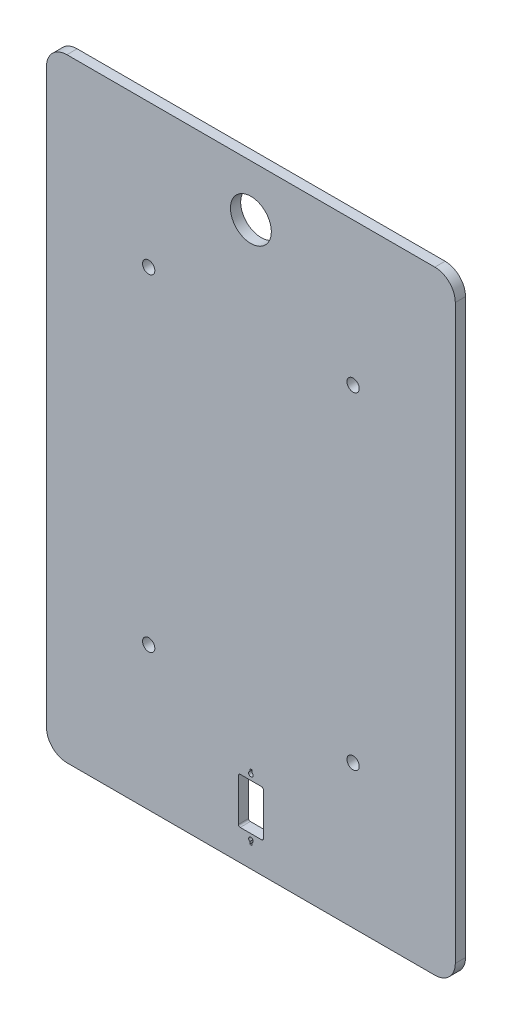
ISO-10303-21;
HEADER;
FILE_DESCRIPTION(('STEP AP214'),'2;1');
FILE_NAME('part.step','',(''),(''),'','','');
FILE_SCHEMA(('AUTOMOTIVE_DESIGN { 1 0 10303 214 1 1 1 1 }'));
ENDSEC;
DATA;
#1=APPLICATION_CONTEXT('core data for automotive mechanical design processes');
#2=APPLICATION_PROTOCOL_DEFINITION('international standard','automotive_design',2000,#1);
#3=PRODUCT_CONTEXT('',#1,'mechanical');
#4=PRODUCT('Part','Part','',(#3));
#5=PRODUCT_RELATED_PRODUCT_CATEGORY('part','',(#4));
#6=PRODUCT_DEFINITION_FORMATION('','',#4);
#7=PRODUCT_DEFINITION_CONTEXT('part definition',#1,'design');
#8=PRODUCT_DEFINITION('design','',#6,#7);
#9=PRODUCT_DEFINITION_SHAPE('','',#8);
#10=(LENGTH_UNIT() NAMED_UNIT(*) SI_UNIT(.MILLI.,.METRE.));
#11=(NAMED_UNIT(*) PLANE_ANGLE_UNIT() SI_UNIT($,.RADIAN.));
#12=(NAMED_UNIT(*) SI_UNIT($,.STERADIAN.) SOLID_ANGLE_UNIT());
#13=UNCERTAINTY_MEASURE_WITH_UNIT(LENGTH_MEASURE(1.E-05),#10,'distance_accuracy_value','');
#14=(GEOMETRIC_REPRESENTATION_CONTEXT(3) GLOBAL_UNCERTAINTY_ASSIGNED_CONTEXT((#13)) GLOBAL_UNIT_ASSIGNED_CONTEXT((#10,
#11,#12)) REPRESENTATION_CONTEXT('',''));
#15=CARTESIAN_POINT('',(0.,0.,0.));
#16=DIRECTION('',(0.,0.,1.));
#17=DIRECTION('',(1.,0.,0.));
#18=AXIS2_PLACEMENT_3D('',#15,#16,#17);
#19=CARTESIAN_POINT('',(-90.,-140.,5.));
#20=DIRECTION('',(0.,0.,1.));
#21=DIRECTION('',(1.,0.,0.));
#22=AXIS2_PLACEMENT_3D('',#19,#20,#21);
#23=PLANE('',#22);
#24=CARTESIAN_POINT('',(-50.,-80.,5.));
#25=DIRECTION('',(0.,0.,1.));
#26=DIRECTION('',(1.,0.,0.));
#27=AXIS2_PLACEMENT_3D('',#24,#25,#26);
#28=CIRCLE('',#27,3.00000000000001);
#29=CARTESIAN_POINT('',(-47.,-80.,5.));
#30=VERTEX_POINT('',#29);
#31=EDGE_CURVE('E296',#30,#30,#28,.T.);
#32=ORIENTED_EDGE('',*,*,#31,.F.);
#33=EDGE_LOOP('',(#32));
#34=FACE_BOUND('',#33,.T.);
#35=CARTESIAN_POINT('',(50.,80.,5.));
#36=DIRECTION('',(0.,0.,1.));
#37=DIRECTION('',(1.,0.,0.));
#38=AXIS2_PLACEMENT_3D('',#35,#36,#37);
#39=CIRCLE('',#38,3.);
#40=CARTESIAN_POINT('',(53.,80.,5.));
#41=VERTEX_POINT('',#40);
#42=EDGE_CURVE('E339',#41,#41,#39,.T.);
#43=ORIENTED_EDGE('',*,*,#42,.F.);
#44=EDGE_LOOP('',(#43));
#45=FACE_BOUND('',#44,.T.);
#46=CARTESIAN_POINT('',(-90.,-140.,5.));
#47=DIRECTION('',(0.,0.,1.));
#48=DIRECTION('',(1.,0.,0.));
#49=AXIS2_PLACEMENT_3D('',#46,#47,#48);
#50=CIRCLE('',#49,10.);
#51=CARTESIAN_POINT('',(-100.,-140.,5.));
#52=VERTEX_POINT('',#51);
#53=CARTESIAN_POINT('',(-89.9999999999999,-150.,5.));
#54=VERTEX_POINT('',#53);
#55=EDGE_CURVE('E351',#52,#54,#50,.T.);
#56=ORIENTED_EDGE('',*,*,#55,.T.);
#57=DIRECTION('',(1.,0.,0.));
#58=VECTOR('',#57,1.);
#59=CARTESIAN_POINT('',(-89.9999999999999,-150.,5.));
#60=LINE('',#59,#58);
#61=CARTESIAN_POINT('',(89.9999999999999,-150.,5.));
#62=VERTEX_POINT('',#61);
#63=EDGE_CURVE('E354',#54,#62,#60,.T.);
#64=ORIENTED_EDGE('',*,*,#63,.T.);
#65=CARTESIAN_POINT('',(90.,-140.,5.));
#66=DIRECTION('',(0.,0.,1.));
#67=DIRECTION('',(1.,0.,0.));
#68=AXIS2_PLACEMENT_3D('',#65,#66,#67);
#69=CIRCLE('',#68,10.);
#70=CARTESIAN_POINT('',(100.,-140.,5.));
#71=VERTEX_POINT('',#70);
#72=EDGE_CURVE('E357',#62,#71,#69,.T.);
#73=ORIENTED_EDGE('',*,*,#72,.T.);
#74=DIRECTION('',(0.,1.,0.));
#75=VECTOR('',#74,1.);
#76=CARTESIAN_POINT('',(100.,140.,5.));
#77=LINE('',#76,#75);
#78=CARTESIAN_POINT('',(100.,140.,5.));
#79=VERTEX_POINT('',#78);
#80=EDGE_CURVE('E359',#71,#79,#77,.T.);
#81=ORIENTED_EDGE('',*,*,#80,.T.);
#82=CARTESIAN_POINT('',(90.,140.,5.));
#83=DIRECTION('',(0.,0.,1.));
#84=DIRECTION('',(-1.,0.,0.));
#85=AXIS2_PLACEMENT_3D('',#82,#83,#84);
#86=CIRCLE('',#85,10.);
#87=CARTESIAN_POINT('',(89.9999999999999,150.,5.));
#88=VERTEX_POINT('',#87);
#89=EDGE_CURVE('E361',#79,#88,#86,.T.);
#90=ORIENTED_EDGE('',*,*,#89,.T.);
#91=DIRECTION('',(-1.,0.,0.));
#92=VECTOR('',#91,1.);
#93=CARTESIAN_POINT('',(-90.,150.,5.));
#94=LINE('',#93,#92);
#95=CARTESIAN_POINT('',(-90.,150.,5.));
#96=VERTEX_POINT('',#95);
#97=EDGE_CURVE('E363',#88,#96,#94,.T.);
#98=ORIENTED_EDGE('',*,*,#97,.T.);
#99=CARTESIAN_POINT('',(-90.0000000000001,140.,5.));
#100=DIRECTION('',(0.,0.,1.));
#101=DIRECTION('',(1.,0.,0.));
#102=AXIS2_PLACEMENT_3D('',#99,#100,#101);
#103=CIRCLE('',#102,10.);
#104=CARTESIAN_POINT('',(-100.,140.,5.));
#105=VERTEX_POINT('',#104);
#106=EDGE_CURVE('E365',#96,#105,#103,.T.);
#107=ORIENTED_EDGE('',*,*,#106,.T.);
#108=DIRECTION('',(0.,-1.,0.));
#109=VECTOR('',#108,1.);
#110=CARTESIAN_POINT('',(-100.,140.,5.));
#111=LINE('',#110,#109);
#112=EDGE_CURVE('E367',#105,#52,#111,.T.);
#113=ORIENTED_EDGE('',*,*,#112,.T.);
#114=EDGE_LOOP('',(#56,#64,#73,#81,#90,#98,#107,#113));
#115=FACE_BOUND('',#114,.T.);
#116=CARTESIAN_POINT('',(0.,125.,5.));
#117=DIRECTION('',(0.,0.,1.));
#118=DIRECTION('',(1.,0.,0.));
#119=AXIS2_PLACEMENT_3D('',#116,#117,#118);
#120=CIRCLE('',#119,10.);
#121=CARTESIAN_POINT('',(10.,125.,5.));
#122=VERTEX_POINT('',#121);
#123=EDGE_CURVE('E345',#122,#122,#120,.T.);
#124=ORIENTED_EDGE('',*,*,#123,.F.);
#125=EDGE_LOOP('',(#124));
#126=FACE_BOUND('',#125,.T.);
#127=CARTESIAN_POINT('',(-50.,80.,5.));
#128=DIRECTION('',(0.,0.,1.));
#129=DIRECTION('',(-1.,0.,0.));
#130=AXIS2_PLACEMENT_3D('',#127,#128,#129);
#131=CIRCLE('',#130,3.);
#132=CARTESIAN_POINT('',(-53.,80.,5.));
#133=VERTEX_POINT('',#132);
#134=EDGE_CURVE('E333',#133,#133,#131,.T.);
#135=ORIENTED_EDGE('',*,*,#134,.F.);
#136=EDGE_LOOP('',(#135));
#137=FACE_BOUND('',#136,.T.);
#138=DIRECTION('',(0.,-1.,0.));
#139=VECTOR('',#138,1.);
#140=CARTESIAN_POINT('',(-0.550000000000008,-138.602627944163,5.));
#141=LINE('',#140,#139);
#142=CARTESIAN_POINT('',(-0.550000000000008,-138.602627944163,5.));
#143=VERTEX_POINT('',#142);
#144=CARTESIAN_POINT('',(-0.550000000000008,-139.8,5.));
#145=VERTEX_POINT('',#144);
#146=EDGE_CURVE('E304',#143,#145,#141,.T.);
#147=ORIENTED_EDGE('',*,*,#146,.F.);
#148=CARTESIAN_POINT('',(0.,-137.65,5.));
#149=DIRECTION('',(0.,0.,1.));
#150=DIRECTION('',(1.,0.,0.));
#151=AXIS2_PLACEMENT_3D('',#148,#149,#150);
#152=CIRCLE('',#151,1.09999999999999);
#153=CARTESIAN_POINT('',(0.549999999999993,-138.602627944163,5.));
#154=VERTEX_POINT('',#153);
#155=EDGE_CURVE('E302',#154,#143,#152,.T.);
#156=ORIENTED_EDGE('',*,*,#155,.F.);
#157=DIRECTION('',(0.,1.,0.));
#158=VECTOR('',#157,1.);
#159=CARTESIAN_POINT('',(0.549999999999995,-139.8,5.));
#160=LINE('',#159,#158);
#161=CARTESIAN_POINT('',(0.549999999999995,-139.8,5.));
#162=VERTEX_POINT('',#161);
#163=EDGE_CURVE('E310',#162,#154,#160,.T.);
#164=ORIENTED_EDGE('',*,*,#163,.F.);
#165=DIRECTION('',(1.,0.,0.));
#166=VECTOR('',#165,1.);
#167=CARTESIAN_POINT('',(-0.550000000000008,-139.8,5.));
#168=LINE('',#167,#166);
#169=EDGE_CURVE('E307',#145,#162,#168,.T.);
#170=ORIENTED_EDGE('',*,*,#169,.F.);
#171=EDGE_LOOP('',(#147,#156,#164,#170));
#172=FACE_BOUND('',#171,.T.);
#173=CARTESIAN_POINT('',(50.,-80.,5.));
#174=DIRECTION('',(0.,0.,1.));
#175=DIRECTION('',(-1.,0.,0.));
#176=AXIS2_PLACEMENT_3D('',#173,#174,#175);
#177=CIRCLE('',#176,2.99999999999999);
#178=CARTESIAN_POINT('',(47.,-80.,5.));
#179=VERTEX_POINT('',#178);
#180=EDGE_CURVE('E290',#179,#179,#177,.T.);
#181=ORIENTED_EDGE('',*,*,#180,.F.);
#182=EDGE_LOOP('',(#181));
#183=FACE_BOUND('',#182,.T.);
#184=DIRECTION('',(0.,1.,0.));
#185=VECTOR('',#184,1.);
#186=CARTESIAN_POINT('',(0.549999999999994,-108.897372055837,5.));
#187=LINE('',#186,#185);
#188=CARTESIAN_POINT('',(0.549999999999994,-108.897372055837,5.));
#189=VERTEX_POINT('',#188);
#190=CARTESIAN_POINT('',(0.549999999999994,-107.7,5.));
#191=VERTEX_POINT('',#190);
#192=EDGE_CURVE('E261',#189,#191,#187,.T.);
#193=ORIENTED_EDGE('',*,*,#192,.F.);
#194=CARTESIAN_POINT('',(0.,-109.85,5.));
#195=DIRECTION('',(0.,0.,1.));
#196=DIRECTION('',(1.,0.,0.));
#197=AXIS2_PLACEMENT_3D('',#194,#195,#196);
#198=CIRCLE('',#197,1.1);
#199=CARTESIAN_POINT('',(-0.550000000000006,-108.897372055837,5.));
#200=VERTEX_POINT('',#199);
#201=EDGE_CURVE('E259',#200,#189,#198,.T.);
#202=ORIENTED_EDGE('',*,*,#201,.F.);
#203=DIRECTION('',(0.,-1.,0.));
#204=VECTOR('',#203,1.);
#205=CARTESIAN_POINT('',(-0.550000000000006,-107.7,5.));
#206=LINE('',#205,#204);
#207=CARTESIAN_POINT('',(-0.550000000000006,-107.7,5.));
#208=VERTEX_POINT('',#207);
#209=EDGE_CURVE('E267',#208,#200,#206,.T.);
#210=ORIENTED_EDGE('',*,*,#209,.F.);
#211=DIRECTION('',(-1.,0.,0.));
#212=VECTOR('',#211,1.);
#213=CARTESIAN_POINT('',(0.549999999999994,-107.7,5.));
#214=LINE('',#213,#212);
#215=EDGE_CURVE('E264',#191,#208,#214,.T.);
#216=ORIENTED_EDGE('',*,*,#215,.F.);
#217=EDGE_LOOP('',(#193,#202,#210,#216));
#218=FACE_BOUND('',#217,.T.);
#219=DIRECTION('',(0.,-1.,0.));
#220=VECTOR('',#219,1.);
#221=CARTESIAN_POINT('',(-6.10000000000001,-113.35,5.));
#222=LINE('',#221,#220);
#223=CARTESIAN_POINT('',(-6.10000000000001,-113.35,5.));
#224=VERTEX_POINT('',#223);
#225=CARTESIAN_POINT('',(-6.10000000000002,-134.15,5.));
#226=VERTEX_POINT('',#225);
#227=EDGE_CURVE('E202',#224,#226,#222,.T.);
#228=ORIENTED_EDGE('',*,*,#227,.F.);
#229=CARTESIAN_POINT('',(-5.25000000000001,-113.35,5.));
#230=DIRECTION('',(0.,0.,1.));
#231=DIRECTION('',(1.,0.,0.));
#232=AXIS2_PLACEMENT_3D('',#229,#230,#231);
#233=CIRCLE('',#232,0.849999999999994);
#234=CARTESIAN_POINT('',(-5.25000000000001,-112.5,5.));
#235=VERTEX_POINT('',#234);
#236=EDGE_CURVE('E194',#235,#224,#233,.T.);
#237=ORIENTED_EDGE('',*,*,#236,.F.);
#238=DIRECTION('',(-1.,0.,0.));
#239=VECTOR('',#238,1.);
#240=CARTESIAN_POINT('',(5.25,-112.5,5.));
#241=LINE('',#240,#239);
#242=CARTESIAN_POINT('',(5.24999999999999,-112.5,5.));
#243=VERTEX_POINT('',#242);
#244=EDGE_CURVE('E227',#243,#235,#241,.T.);
#245=ORIENTED_EDGE('',*,*,#244,.F.);
#246=CARTESIAN_POINT('',(5.25,-113.35,5.));
#247=DIRECTION('',(0.,0.,1.));
#248=DIRECTION('',(1.,0.,0.));
#249=AXIS2_PLACEMENT_3D('',#246,#247,#248);
#250=CIRCLE('',#249,0.849999999999991);
#251=CARTESIAN_POINT('',(6.09999999999999,-113.35,5.));
#252=VERTEX_POINT('',#251);
#253=EDGE_CURVE('E225',#252,#243,#250,.T.);
#254=ORIENTED_EDGE('',*,*,#253,.F.);
#255=DIRECTION('',(0.,1.,0.));
#256=VECTOR('',#255,1.);
#257=CARTESIAN_POINT('',(6.09999999999999,-134.15,5.));
#258=LINE('',#257,#256);
#259=CARTESIAN_POINT('',(6.09999999999999,-134.15,5.));
#260=VERTEX_POINT('',#259);
#261=EDGE_CURVE('E223',#260,#252,#258,.T.);
#262=ORIENTED_EDGE('',*,*,#261,.F.);
#263=CARTESIAN_POINT('',(5.24999999999999,-134.15,5.));
#264=DIRECTION('',(0.,0.,1.));
#265=DIRECTION('',(1.,0.,0.));
#266=AXIS2_PLACEMENT_3D('',#263,#264,#265);
#267=CIRCLE('',#266,0.850000000000008);
#268=CARTESIAN_POINT('',(5.24999999999999,-135.,5.));
#269=VERTEX_POINT('',#268);
#270=EDGE_CURVE('E221',#269,#260,#267,.T.);
#271=ORIENTED_EDGE('',*,*,#270,.F.);
#272=DIRECTION('',(1.,0.,0.));
#273=VECTOR('',#272,1.);
#274=CARTESIAN_POINT('',(-5.25000000000001,-135.,5.));
#275=LINE('',#274,#273);
#276=CARTESIAN_POINT('',(-5.25000000000001,-135.,5.));
#277=VERTEX_POINT('',#276);
#278=EDGE_CURVE('E217',#277,#269,#275,.T.);
#279=ORIENTED_EDGE('',*,*,#278,.F.);
#280=CARTESIAN_POINT('',(-5.25000000000001,-134.15,5.));
#281=DIRECTION('',(0.,0.,1.));
#282=DIRECTION('',(1.,0.,0.));
#283=AXIS2_PLACEMENT_3D('',#280,#281,#282);
#284=CIRCLE('',#283,0.850000000000008);
#285=EDGE_CURVE('E215',#226,#277,#284,.T.);
#286=ORIENTED_EDGE('',*,*,#285,.F.);
#287=EDGE_LOOP('',(#228,#237,#245,#254,#262,#271,#279,#286));
#288=FACE_BOUND('',#287,.T.);
#289=ADVANCED_FACE('F33',(#34,#45,#115,#126,#137,#172,#183,#218,#288),#23,.T.);
#290=CARTESIAN_POINT('',(-90.,-140.,0.));
#291=DIRECTION('',(0.,0.,1.));
#292=DIRECTION('',(1.,0.,0.));
#293=AXIS2_PLACEMENT_3D('',#290,#291,#292);
#294=PLANE('',#293);
#295=CARTESIAN_POINT('',(0.,-109.85,0.));
#296=DIRECTION('',(0.,0.,1.));
#297=DIRECTION('',(1.,0.,0.));
#298=AXIS2_PLACEMENT_3D('',#295,#296,#297);
#299=CIRCLE('',#298,1.1);
#300=CARTESIAN_POINT('',(-0.550000000000006,-108.897372055837,0.));
#301=VERTEX_POINT('',#300);
#302=CARTESIAN_POINT('',(0.549999999999994,-108.897372055837,0.));
#303=VERTEX_POINT('',#302);
#304=EDGE_CURVE('E210',#301,#303,#299,.T.);
#305=ORIENTED_EDGE('',*,*,#304,.T.);
#306=DIRECTION('',(0.,1.,0.));
#307=VECTOR('',#306,1.);
#308=CARTESIAN_POINT('',(0.549999999999994,-108.897372055837,0.));
#309=LINE('',#308,#307);
#310=CARTESIAN_POINT('',(0.549999999999994,-107.7,0.));
#311=VERTEX_POINT('',#310);
#312=EDGE_CURVE('E272',#303,#311,#309,.T.);
#313=ORIENTED_EDGE('',*,*,#312,.T.);
#314=DIRECTION('',(-1.,0.,0.));
#315=VECTOR('',#314,1.);
#316=CARTESIAN_POINT('',(0.549999999999994,-107.7,0.));
#317=LINE('',#316,#315);
#318=CARTESIAN_POINT('',(-0.550000000000006,-107.7,0.));
#319=VERTEX_POINT('',#318);
#320=EDGE_CURVE('E275',#311,#319,#317,.T.);
#321=ORIENTED_EDGE('',*,*,#320,.T.);
#322=DIRECTION('',(0.,-1.,0.));
#323=VECTOR('',#322,1.);
#324=CARTESIAN_POINT('',(-0.550000000000006,-107.7,0.));
#325=LINE('',#324,#323);
#326=EDGE_CURVE('E262',#319,#301,#325,.T.);
#327=ORIENTED_EDGE('',*,*,#326,.T.);
#328=EDGE_LOOP('',(#305,#313,#321,#327));
#329=FACE_BOUND('',#328,.T.);
#330=CARTESIAN_POINT('',(-50.,80.,0.));
#331=DIRECTION('',(0.,0.,1.));
#332=DIRECTION('',(-1.,0.,0.));
#333=AXIS2_PLACEMENT_3D('',#330,#331,#332);
#334=CIRCLE('',#333,3.);
#335=CARTESIAN_POINT('',(-53.,80.,0.));
#336=VERTEX_POINT('',#335);
#337=EDGE_CURVE('E332',#336,#336,#334,.T.);
#338=ORIENTED_EDGE('',*,*,#337,.T.);
#339=EDGE_LOOP('',(#338));
#340=FACE_BOUND('',#339,.T.);
#341=CARTESIAN_POINT('',(50.,80.,0.));
#342=DIRECTION('',(0.,0.,1.));
#343=DIRECTION('',(1.,0.,0.));
#344=AXIS2_PLACEMENT_3D('',#341,#342,#343);
#345=CIRCLE('',#344,3.);
#346=CARTESIAN_POINT('',(53.,80.,0.));
#347=VERTEX_POINT('',#346);
#348=EDGE_CURVE('E336',#347,#347,#345,.T.);
#349=ORIENTED_EDGE('',*,*,#348,.T.);
#350=EDGE_LOOP('',(#349));
#351=FACE_BOUND('',#350,.T.);
#352=CARTESIAN_POINT('',(0.,125.,0.));
#353=DIRECTION('',(0.,0.,1.));
#354=DIRECTION('',(1.,0.,0.));
#355=AXIS2_PLACEMENT_3D('',#352,#353,#354);
#356=CIRCLE('',#355,10.);
#357=CARTESIAN_POINT('',(10.,125.,0.));
#358=VERTEX_POINT('',#357);
#359=EDGE_CURVE('E342',#358,#358,#356,.T.);
#360=ORIENTED_EDGE('',*,*,#359,.T.);
#361=EDGE_LOOP('',(#360));
#362=FACE_BOUND('',#361,.T.);
#363=CARTESIAN_POINT('',(-90.,-140.,0.));
#364=DIRECTION('',(0.,0.,1.));
#365=DIRECTION('',(1.,0.,0.));
#366=AXIS2_PLACEMENT_3D('',#363,#364,#365);
#367=CIRCLE('',#366,10.);
#368=CARTESIAN_POINT('',(-100.,-140.,0.));
#369=VERTEX_POINT('',#368);
#370=CARTESIAN_POINT('',(-89.9999999999999,-150.,0.));
#371=VERTEX_POINT('',#370);
#372=EDGE_CURVE('E348',#369,#371,#367,.T.);
#373=ORIENTED_EDGE('',*,*,#372,.F.);
#374=DIRECTION('',(0.,-1.,0.));
#375=VECTOR('',#374,1.);
#376=CARTESIAN_POINT('',(-100.,140.,0.));
#377=LINE('',#376,#375);
#378=CARTESIAN_POINT('',(-100.,140.,0.));
#379=VERTEX_POINT('',#378);
#380=EDGE_CURVE('E355',#379,#369,#377,.T.);
#381=ORIENTED_EDGE('',*,*,#380,.F.);
#382=CARTESIAN_POINT('',(-90.0000000000001,140.,0.));
#383=DIRECTION('',(0.,0.,1.));
#384=DIRECTION('',(1.,0.,0.));
#385=AXIS2_PLACEMENT_3D('',#382,#383,#384);
#386=CIRCLE('',#385,10.);
#387=CARTESIAN_POINT('',(-90.,150.,0.));
#388=VERTEX_POINT('',#387);
#389=EDGE_CURVE('E382',#388,#379,#386,.T.);
#390=ORIENTED_EDGE('',*,*,#389,.F.);
#391=DIRECTION('',(-1.,0.,0.));
#392=VECTOR('',#391,1.);
#393=CARTESIAN_POINT('',(-90.,150.,0.));
#394=LINE('',#393,#392);
#395=CARTESIAN_POINT('',(89.9999999999999,150.,0.));
#396=VERTEX_POINT('',#395);
#397=EDGE_CURVE('E380',#396,#388,#394,.T.);
#398=ORIENTED_EDGE('',*,*,#397,.F.);
#399=CARTESIAN_POINT('',(90.,140.,0.));
#400=DIRECTION('',(0.,0.,1.));
#401=DIRECTION('',(-1.,0.,0.));
#402=AXIS2_PLACEMENT_3D('',#399,#400,#401);
#403=CIRCLE('',#402,10.);
#404=CARTESIAN_POINT('',(100.,140.,0.));
#405=VERTEX_POINT('',#404);
#406=EDGE_CURVE('E378',#405,#396,#403,.T.);
#407=ORIENTED_EDGE('',*,*,#406,.F.);
#408=DIRECTION('',(0.,1.,0.));
#409=VECTOR('',#408,1.);
#410=CARTESIAN_POINT('',(100.,140.,0.));
#411=LINE('',#410,#409);
#412=CARTESIAN_POINT('',(100.,-140.,0.));
#413=VERTEX_POINT('',#412);
#414=EDGE_CURVE('E376',#413,#405,#411,.T.);
#415=ORIENTED_EDGE('',*,*,#414,.F.);
#416=CARTESIAN_POINT('',(90.,-140.,0.));
#417=DIRECTION('',(0.,0.,1.));
#418=DIRECTION('',(1.,0.,0.));
#419=AXIS2_PLACEMENT_3D('',#416,#417,#418);
#420=CIRCLE('',#419,10.);
#421=CARTESIAN_POINT('',(89.9999999999999,-150.,0.));
#422=VERTEX_POINT('',#421);
#423=EDGE_CURVE('E374',#422,#413,#420,.T.);
#424=ORIENTED_EDGE('',*,*,#423,.F.);
#425=DIRECTION('',(1.,0.,0.));
#426=VECTOR('',#425,1.);
#427=CARTESIAN_POINT('',(-89.9999999999999,-150.,0.));
#428=LINE('',#427,#426);
#429=EDGE_CURVE('E372',#371,#422,#428,.T.);
#430=ORIENTED_EDGE('',*,*,#429,.F.);
#431=EDGE_LOOP('',(#373,#381,#390,#398,#407,#415,#424,#430));
#432=FACE_BOUND('',#431,.T.);
#433=CARTESIAN_POINT('',(0.,-137.65,0.));
#434=DIRECTION('',(0.,0.,1.));
#435=DIRECTION('',(1.,0.,0.));
#436=AXIS2_PLACEMENT_3D('',#433,#434,#435);
#437=CIRCLE('',#436,1.09999999999999);
#438=CARTESIAN_POINT('',(0.549999999999993,-138.602627944163,0.));
#439=VERTEX_POINT('',#438);
#440=CARTESIAN_POINT('',(-0.550000000000008,-138.602627944163,0.));
#441=VERTEX_POINT('',#440);
#442=EDGE_CURVE('E299',#439,#441,#437,.T.);
#443=ORIENTED_EDGE('',*,*,#442,.T.);
#444=DIRECTION('',(0.,-1.,0.));
#445=VECTOR('',#444,1.);
#446=CARTESIAN_POINT('',(-0.550000000000008,-138.602627944163,0.));
#447=LINE('',#446,#445);
#448=CARTESIAN_POINT('',(-0.550000000000008,-139.8,0.));
#449=VERTEX_POINT('',#448);
#450=EDGE_CURVE('E315',#441,#449,#447,.T.);
#451=ORIENTED_EDGE('',*,*,#450,.T.);
#452=DIRECTION('',(1.,0.,0.));
#453=VECTOR('',#452,1.);
#454=CARTESIAN_POINT('',(-0.550000000000008,-139.8,0.));
#455=LINE('',#454,#453);
#456=CARTESIAN_POINT('',(0.549999999999995,-139.8,0.));
#457=VERTEX_POINT('',#456);
#458=EDGE_CURVE('E318',#449,#457,#455,.T.);
#459=ORIENTED_EDGE('',*,*,#458,.T.);
#460=DIRECTION('',(0.,1.,0.));
#461=VECTOR('',#460,1.);
#462=CARTESIAN_POINT('',(0.549999999999995,-139.8,0.));
#463=LINE('',#462,#461);
#464=EDGE_CURVE('E305',#457,#439,#463,.T.);
#465=ORIENTED_EDGE('',*,*,#464,.T.);
#466=EDGE_LOOP('',(#443,#451,#459,#465));
#467=FACE_BOUND('',#466,.T.);
#468=CARTESIAN_POINT('',(-50.,-80.,0.));
#469=DIRECTION('',(0.,0.,1.));
#470=DIRECTION('',(1.,0.,0.));
#471=AXIS2_PLACEMENT_3D('',#468,#469,#470);
#472=CIRCLE('',#471,3.00000000000001);
#473=CARTESIAN_POINT('',(-47.,-80.,0.));
#474=VERTEX_POINT('',#473);
#475=EDGE_CURVE('E293',#474,#474,#472,.T.);
#476=ORIENTED_EDGE('',*,*,#475,.T.);
#477=EDGE_LOOP('',(#476));
#478=FACE_BOUND('',#477,.T.);
#479=CARTESIAN_POINT('',(50.,-80.,0.));
#480=DIRECTION('',(0.,0.,1.));
#481=DIRECTION('',(-1.,0.,0.));
#482=AXIS2_PLACEMENT_3D('',#479,#480,#481);
#483=CIRCLE('',#482,2.99999999999999);
#484=CARTESIAN_POINT('',(47.,-80.,0.));
#485=VERTEX_POINT('',#484);
#486=EDGE_CURVE('E289',#485,#485,#483,.T.);
#487=ORIENTED_EDGE('',*,*,#486,.T.);
#488=EDGE_LOOP('',(#487));
#489=FACE_BOUND('',#488,.T.);
#490=CARTESIAN_POINT('',(-5.25000000000001,-113.35,0.));
#491=DIRECTION('',(0.,0.,1.));
#492=DIRECTION('',(1.,0.,0.));
#493=AXIS2_PLACEMENT_3D('',#490,#491,#492);
#494=CIRCLE('',#493,0.849999999999994);
#495=CARTESIAN_POINT('',(-5.25,-112.5,0.));
#496=VERTEX_POINT('',#495);
#497=CARTESIAN_POINT('',(-6.10000000000001,-113.35,0.));
#498=VERTEX_POINT('',#497);
#499=EDGE_CURVE('E56',#496,#498,#494,.T.);
#500=ORIENTED_EDGE('',*,*,#499,.T.);
#501=DIRECTION('',(0.,-1.,0.));
#502=VECTOR('',#501,1.);
#503=CARTESIAN_POINT('',(-6.10000000000001,-113.35,0.));
#504=LINE('',#503,#502);
#505=CARTESIAN_POINT('',(-6.10000000000002,-134.15,0.));
#506=VERTEX_POINT('',#505);
#507=EDGE_CURVE('E209',#498,#506,#504,.T.);
#508=ORIENTED_EDGE('',*,*,#507,.T.);
#509=CARTESIAN_POINT('',(-5.25000000000001,-134.15,0.));
#510=DIRECTION('',(0.,0.,1.));
#511=DIRECTION('',(1.,0.,0.));
#512=AXIS2_PLACEMENT_3D('',#509,#510,#511);
#513=CIRCLE('',#512,0.850000000000008);
#514=CARTESIAN_POINT('',(-5.25000000000001,-135.,0.));
#515=VERTEX_POINT('',#514);
#516=EDGE_CURVE('E231',#506,#515,#513,.T.);
#517=ORIENTED_EDGE('',*,*,#516,.T.);
#518=DIRECTION('',(1.,0.,0.));
#519=VECTOR('',#518,1.);
#520=CARTESIAN_POINT('',(-5.25000000000001,-135.,0.));
#521=LINE('',#520,#519);
#522=CARTESIAN_POINT('',(5.24999999999999,-135.,0.));
#523=VERTEX_POINT('',#522);
#524=EDGE_CURVE('E234',#515,#523,#521,.T.);
#525=ORIENTED_EDGE('',*,*,#524,.T.);
#526=CARTESIAN_POINT('',(5.24999999999999,-134.15,0.));
#527=DIRECTION('',(0.,0.,1.));
#528=DIRECTION('',(1.,0.,0.));
#529=AXIS2_PLACEMENT_3D('',#526,#527,#528);
#530=CIRCLE('',#529,0.850000000000008);
#531=CARTESIAN_POINT('',(6.09999999999999,-134.15,0.));
#532=VERTEX_POINT('',#531);
#533=EDGE_CURVE('E237',#523,#532,#530,.T.);
#534=ORIENTED_EDGE('',*,*,#533,.T.);
#535=DIRECTION('',(0.,1.,0.));
#536=VECTOR('',#535,1.);
#537=CARTESIAN_POINT('',(6.09999999999999,-134.15,0.));
#538=LINE('',#537,#536);
#539=CARTESIAN_POINT('',(6.09999999999999,-113.35,0.));
#540=VERTEX_POINT('',#539);
#541=EDGE_CURVE('E240',#532,#540,#538,.T.);
#542=ORIENTED_EDGE('',*,*,#541,.T.);
#543=CARTESIAN_POINT('',(5.25,-113.35,0.));
#544=DIRECTION('',(0.,0.,1.));
#545=DIRECTION('',(1.,0.,0.));
#546=AXIS2_PLACEMENT_3D('',#543,#544,#545);
#547=CIRCLE('',#546,0.849999999999991);
#548=CARTESIAN_POINT('',(5.25,-112.5,0.));
#549=VERTEX_POINT('',#548);
#550=EDGE_CURVE('E243',#540,#549,#547,.T.);
#551=ORIENTED_EDGE('',*,*,#550,.T.);
#552=DIRECTION('',(-1.,0.,0.));
#553=VECTOR('',#552,1.);
#554=CARTESIAN_POINT('',(5.25,-112.5,0.));
#555=LINE('',#554,#553);
#556=EDGE_CURVE('E203',#549,#496,#555,.T.);
#557=ORIENTED_EDGE('',*,*,#556,.T.);
#558=EDGE_LOOP('',(#500,#508,#517,#525,#534,#542,#551,#557));
#559=FACE_BOUND('',#558,.T.);
#560=ADVANCED_FACE('F412',(#329,#340,#351,#362,#432,#467,#478,#489,#559),#294,.F.);
#561=CARTESIAN_POINT('',(-90.,-140.,5.));
#562=DIRECTION('',(0.,0.,-1.));
#563=DIRECTION('',(-1.,0.,0.));
#564=AXIS2_PLACEMENT_3D('',#561,#562,#563);
#565=CYLINDRICAL_SURFACE('',#564,10.);
#566=ORIENTED_EDGE('',*,*,#372,.T.);
#567=DIRECTION('',(0.,0.,-1.));
#568=VECTOR('',#567,1.);
#569=CARTESIAN_POINT('',(-89.9999999999999,-150.,5.));
#570=LINE('',#569,#568);
#571=EDGE_CURVE('E11',#54,#371,#570,.T.);
#572=ORIENTED_EDGE('',*,*,#571,.F.);
#573=ORIENTED_EDGE('',*,*,#55,.F.);
#574=DIRECTION('',(0.,0.,-1.));
#575=VECTOR('',#574,1.);
#576=CARTESIAN_POINT('',(-100.,-140.,5.));
#577=LINE('',#576,#575);
#578=EDGE_CURVE('E369',#52,#369,#577,.T.);
#579=ORIENTED_EDGE('',*,*,#578,.T.);
#580=EDGE_LOOP('',(#566,#572,#573,#579));
#581=FACE_BOUND('',#580,.T.);
#582=ADVANCED_FACE('F35',(#581),#565,.T.);
#583=CARTESIAN_POINT('',(-89.9999999999999,-150.,5.));
#584=DIRECTION('',(0.,1.,0.));
#585=DIRECTION('',(0.,0.,1.));
#586=AXIS2_PLACEMENT_3D('',#583,#584,#585);
#587=PLANE('',#586);
#588=ORIENTED_EDGE('',*,*,#429,.T.);
#589=DIRECTION('',(0.,0.,-1.));
#590=VECTOR('',#589,1.);
#591=CARTESIAN_POINT('',(89.9999999999999,-150.,5.));
#592=LINE('',#591,#590);
#593=EDGE_CURVE('E41',#62,#422,#592,.T.);
#594=ORIENTED_EDGE('',*,*,#593,.F.);
#595=ORIENTED_EDGE('',*,*,#63,.F.);
#596=ORIENTED_EDGE('',*,*,#571,.T.);
#597=EDGE_LOOP('',(#588,#594,#595,#596));
#598=FACE_BOUND('',#597,.T.);
#599=ADVANCED_FACE('F430',(#598),#587,.F.);
#600=CARTESIAN_POINT('',(90.,-140.,5.));
#601=DIRECTION('',(0.,0.,-1.));
#602=DIRECTION('',(-1.,0.,0.));
#603=AXIS2_PLACEMENT_3D('',#600,#601,#602);
#604=CYLINDRICAL_SURFACE('',#603,10.);
#605=ORIENTED_EDGE('',*,*,#423,.T.);
#606=DIRECTION('',(0.,0.,-1.));
#607=VECTOR('',#606,1.);
#608=CARTESIAN_POINT('',(100.,-140.,5.));
#609=LINE('',#608,#607);
#610=EDGE_CURVE('E399',#71,#413,#609,.T.);
#611=ORIENTED_EDGE('',*,*,#610,.F.);
#612=ORIENTED_EDGE('',*,*,#72,.F.);
#613=ORIENTED_EDGE('',*,*,#593,.T.);
#614=EDGE_LOOP('',(#605,#611,#612,#613));
#615=FACE_BOUND('',#614,.T.);
#616=ADVANCED_FACE('F406',(#615),#604,.T.);
#617=CARTESIAN_POINT('',(100.,140.,5.));
#618=DIRECTION('',(-1.,0.,0.));
#619=DIRECTION('',(0.,-1.,0.));
#620=AXIS2_PLACEMENT_3D('',#617,#618,#619);
#621=PLANE('',#620);
#622=ORIENTED_EDGE('',*,*,#414,.T.);
#623=DIRECTION('',(0.,0.,-1.));
#624=VECTOR('',#623,1.);
#625=CARTESIAN_POINT('',(100.,140.,5.));
#626=LINE('',#625,#624);
#627=EDGE_CURVE('E396',#79,#405,#626,.T.);
#628=ORIENTED_EDGE('',*,*,#627,.F.);
#629=ORIENTED_EDGE('',*,*,#80,.F.);
#630=ORIENTED_EDGE('',*,*,#610,.T.);
#631=EDGE_LOOP('',(#622,#628,#629,#630));
#632=FACE_BOUND('',#631,.T.);
#633=ADVANCED_FACE('F418',(#632),#621,.F.);
#634=CARTESIAN_POINT('',(90.,140.,5.));
#635=DIRECTION('',(0.,0.,-1.));
#636=DIRECTION('',(-1.,0.,0.));
#637=AXIS2_PLACEMENT_3D('',#634,#635,#636);
#638=CYLINDRICAL_SURFACE('',#637,10.);
#639=ORIENTED_EDGE('',*,*,#406,.T.);
#640=DIRECTION('',(0.,0.,-1.));
#641=VECTOR('',#640,1.);
#642=CARTESIAN_POINT('',(89.9999999999999,150.,5.));
#643=LINE('',#642,#641);
#644=EDGE_CURVE('E393',#88,#396,#643,.T.);
#645=ORIENTED_EDGE('',*,*,#644,.F.);
#646=ORIENTED_EDGE('',*,*,#89,.F.);
#647=ORIENTED_EDGE('',*,*,#627,.T.);
#648=EDGE_LOOP('',(#639,#645,#646,#647));
#649=FACE_BOUND('',#648,.T.);
#650=ADVANCED_FACE('F422',(#649),#638,.T.);
#651=CARTESIAN_POINT('',(-90.,150.,5.));
#652=DIRECTION('',(0.,-1.,0.));
#653=DIRECTION('',(0.,0.,-1.));
#654=AXIS2_PLACEMENT_3D('',#651,#652,#653);
#655=PLANE('',#654);
#656=ORIENTED_EDGE('',*,*,#397,.T.);
#657=DIRECTION('',(0.,0.,-1.));
#658=VECTOR('',#657,1.);
#659=CARTESIAN_POINT('',(-90.,150.,5.));
#660=LINE('',#659,#658);
#661=EDGE_CURVE('E390',#96,#388,#660,.T.);
#662=ORIENTED_EDGE('',*,*,#661,.F.);
#663=ORIENTED_EDGE('',*,*,#97,.F.);
#664=ORIENTED_EDGE('',*,*,#644,.T.);
#665=EDGE_LOOP('',(#656,#662,#663,#664));
#666=FACE_BOUND('',#665,.T.);
#667=ADVANCED_FACE('F443',(#666),#655,.F.);
#668=CARTESIAN_POINT('',(-90.0000000000001,140.,5.));
#669=DIRECTION('',(0.,0.,-1.));
#670=DIRECTION('',(-1.,0.,0.));
#671=AXIS2_PLACEMENT_3D('',#668,#669,#670);
#672=CYLINDRICAL_SURFACE('',#671,10.);
#673=ORIENTED_EDGE('',*,*,#389,.T.);
#674=DIRECTION('',(0.,0.,-1.));
#675=VECTOR('',#674,1.);
#676=CARTESIAN_POINT('',(-100.,140.,5.));
#677=LINE('',#676,#675);
#678=EDGE_CURVE('E387',#105,#379,#677,.T.);
#679=ORIENTED_EDGE('',*,*,#678,.F.);
#680=ORIENTED_EDGE('',*,*,#106,.F.);
#681=ORIENTED_EDGE('',*,*,#661,.T.);
#682=EDGE_LOOP('',(#673,#679,#680,#681));
#683=FACE_BOUND('',#682,.T.);
#684=ADVANCED_FACE('F441',(#683),#672,.T.);
#685=CARTESIAN_POINT('',(-100.,140.,5.));
#686=DIRECTION('',(1.,0.,0.));
#687=DIRECTION('',(0.,1.,0.));
#688=AXIS2_PLACEMENT_3D('',#685,#686,#687);
#689=PLANE('',#688);
#690=ORIENTED_EDGE('',*,*,#380,.T.);
#691=ORIENTED_EDGE('',*,*,#578,.F.);
#692=ORIENTED_EDGE('',*,*,#112,.F.);
#693=ORIENTED_EDGE('',*,*,#678,.T.);
#694=EDGE_LOOP('',(#690,#691,#692,#693));
#695=FACE_BOUND('',#694,.T.);
#696=ADVANCED_FACE('F436',(#695),#689,.F.);
#697=CARTESIAN_POINT('',(0.,125.,5.));
#698=DIRECTION('',(0.,0.,-1.));
#699=DIRECTION('',(-1.,0.,0.));
#700=AXIS2_PLACEMENT_3D('',#697,#698,#699);
#701=CYLINDRICAL_SURFACE('',#700,10.);
#702=ORIENTED_EDGE('',*,*,#123,.T.);
#703=EDGE_LOOP('',(#702));
#704=FACE_BOUND('',#703,.T.);
#705=ORIENTED_EDGE('',*,*,#359,.F.);
#706=EDGE_LOOP('',(#705));
#707=FACE_BOUND('',#706,.T.);
#708=ADVANCED_FACE('F463',(#704,#707),#701,.F.);
#709=CARTESIAN_POINT('',(50.,80.,5.));
#710=DIRECTION('',(0.,0.,-1.));
#711=DIRECTION('',(-1.,0.,0.));
#712=AXIS2_PLACEMENT_3D('',#709,#710,#711);
#713=CYLINDRICAL_SURFACE('',#712,3.);
#714=ORIENTED_EDGE('',*,*,#42,.T.);
#715=EDGE_LOOP('',(#714));
#716=FACE_BOUND('',#715,.T.);
#717=ORIENTED_EDGE('',*,*,#348,.F.);
#718=EDGE_LOOP('',(#717));
#719=FACE_BOUND('',#718,.T.);
#720=ADVANCED_FACE('F470',(#716,#719),#713,.F.);
#721=CARTESIAN_POINT('',(-50.,80.,5.));
#722=DIRECTION('',(0.,0.,-1.));
#723=DIRECTION('',(-1.,0.,0.));
#724=AXIS2_PLACEMENT_3D('',#721,#722,#723);
#725=CYLINDRICAL_SURFACE('',#724,3.);
#726=ORIENTED_EDGE('',*,*,#134,.T.);
#727=EDGE_LOOP('',(#726));
#728=FACE_BOUND('',#727,.T.);
#729=ORIENTED_EDGE('',*,*,#337,.F.);
#730=EDGE_LOOP('',(#729));
#731=FACE_BOUND('',#730,.T.);
#732=ADVANCED_FACE('F475',(#728,#731),#725,.F.);
#733=CARTESIAN_POINT('',(0.,-137.65,5.));
#734=DIRECTION('',(0.,0.,-1.));
#735=DIRECTION('',(-1.,0.,0.));
#736=AXIS2_PLACEMENT_3D('',#733,#734,#735);
#737=CYLINDRICAL_SURFACE('',#736,1.09999999999999);
#738=ORIENTED_EDGE('',*,*,#442,.F.);
#739=DIRECTION('',(0.,0.,-1.));
#740=VECTOR('',#739,1.);
#741=CARTESIAN_POINT('',(0.549999999999993,-138.602627944163,5.));
#742=LINE('',#741,#740);
#743=EDGE_CURVE('E312',#154,#439,#742,.T.);
#744=ORIENTED_EDGE('',*,*,#743,.F.);
#745=ORIENTED_EDGE('',*,*,#155,.T.);
#746=DIRECTION('',(0.,0.,-1.));
#747=VECTOR('',#746,1.);
#748=CARTESIAN_POINT('',(-0.550000000000008,-138.602627944163,5.));
#749=LINE('',#748,#747);
#750=EDGE_CURVE('E329',#143,#441,#749,.T.);
#751=ORIENTED_EDGE('',*,*,#750,.T.);
#752=EDGE_LOOP('',(#738,#744,#745,#751));
#753=FACE_BOUND('',#752,.T.);
#754=ADVANCED_FACE('F541',(#753),#737,.F.);
#755=CARTESIAN_POINT('',(-0.550000000000008,-138.602627944163,5.));
#756=DIRECTION('',(1.,0.,0.));
#757=DIRECTION('',(0.,0.,-1.));
#758=AXIS2_PLACEMENT_3D('',#755,#756,#757);
#759=PLANE('',#758);
#760=ORIENTED_EDGE('',*,*,#450,.F.);
#761=ORIENTED_EDGE('',*,*,#750,.F.);
#762=ORIENTED_EDGE('',*,*,#146,.T.);
#763=DIRECTION('',(0.,0.,-1.));
#764=VECTOR('',#763,1.);
#765=CARTESIAN_POINT('',(-0.550000000000008,-139.8,5.));
#766=LINE('',#765,#764);
#767=EDGE_CURVE('E327',#145,#449,#766,.T.);
#768=ORIENTED_EDGE('',*,*,#767,.T.);
#769=EDGE_LOOP('',(#760,#761,#762,#768));
#770=FACE_BOUND('',#769,.T.);
#771=ADVANCED_FACE('F537',(#770),#759,.T.);
#772=CARTESIAN_POINT('',(-0.550000000000008,-139.8,5.));
#773=DIRECTION('',(0.,1.,0.));
#774=DIRECTION('',(0.,0.,1.));
#775=AXIS2_PLACEMENT_3D('',#772,#773,#774);
#776=PLANE('',#775);
#777=ORIENTED_EDGE('',*,*,#458,.F.);
#778=ORIENTED_EDGE('',*,*,#767,.F.);
#779=ORIENTED_EDGE('',*,*,#169,.T.);
#780=DIRECTION('',(0.,0.,-1.));
#781=VECTOR('',#780,1.);
#782=CARTESIAN_POINT('',(0.549999999999995,-139.8,5.));
#783=LINE('',#782,#781);
#784=EDGE_CURVE('E325',#162,#457,#783,.T.);
#785=ORIENTED_EDGE('',*,*,#784,.T.);
#786=EDGE_LOOP('',(#777,#778,#779,#785));
#787=FACE_BOUND('',#786,.T.);
#788=ADVANCED_FACE('F533',(#787),#776,.T.);
#789=CARTESIAN_POINT('',(0.549999999999995,-139.8,5.));
#790=DIRECTION('',(-1.,0.,0.));
#791=DIRECTION('',(0.,-1.,0.));
#792=AXIS2_PLACEMENT_3D('',#789,#790,#791);
#793=PLANE('',#792);
#794=ORIENTED_EDGE('',*,*,#464,.F.);
#795=ORIENTED_EDGE('',*,*,#784,.F.);
#796=ORIENTED_EDGE('',*,*,#163,.T.);
#797=ORIENTED_EDGE('',*,*,#743,.T.);
#798=EDGE_LOOP('',(#794,#795,#796,#797));
#799=FACE_BOUND('',#798,.T.);
#800=ADVANCED_FACE('F529',(#799),#793,.T.);
#801=CARTESIAN_POINT('',(-50.,-80.,5.));
#802=DIRECTION('',(0.,0.,-1.));
#803=DIRECTION('',(-1.,0.,0.));
#804=AXIS2_PLACEMENT_3D('',#801,#802,#803);
#805=CYLINDRICAL_SURFACE('',#804,3.00000000000001);
#806=ORIENTED_EDGE('',*,*,#31,.T.);
#807=EDGE_LOOP('',(#806));
#808=FACE_BOUND('',#807,.T.);
#809=ORIENTED_EDGE('',*,*,#475,.F.);
#810=EDGE_LOOP('',(#809));
#811=FACE_BOUND('',#810,.T.);
#812=ADVANCED_FACE('F525',(#808,#811),#805,.F.);
#813=CARTESIAN_POINT('',(50.,-80.,5.));
#814=DIRECTION('',(0.,0.,-1.));
#815=DIRECTION('',(-1.,0.,0.));
#816=AXIS2_PLACEMENT_3D('',#813,#814,#815);
#817=CYLINDRICAL_SURFACE('',#816,2.99999999999999);
#818=ORIENTED_EDGE('',*,*,#180,.T.);
#819=EDGE_LOOP('',(#818));
#820=FACE_BOUND('',#819,.T.);
#821=ORIENTED_EDGE('',*,*,#486,.F.);
#822=EDGE_LOOP('',(#821));
#823=FACE_BOUND('',#822,.T.);
#824=ADVANCED_FACE('F522',(#820,#823),#817,.F.);
#825=CARTESIAN_POINT('',(0.,-109.85,5.));
#826=DIRECTION('',(0.,0.,-1.));
#827=DIRECTION('',(-1.,0.,0.));
#828=AXIS2_PLACEMENT_3D('',#825,#826,#827);
#829=CYLINDRICAL_SURFACE('',#828,1.1);
#830=ORIENTED_EDGE('',*,*,#304,.F.);
#831=DIRECTION('',(0.,0.,-1.));
#832=VECTOR('',#831,1.);
#833=CARTESIAN_POINT('',(-0.550000000000006,-108.897372055837,5.));
#834=LINE('',#833,#832);
#835=EDGE_CURVE('E269',#200,#301,#834,.T.);
#836=ORIENTED_EDGE('',*,*,#835,.F.);
#837=ORIENTED_EDGE('',*,*,#201,.T.);
#838=DIRECTION('',(0.,0.,-1.));
#839=VECTOR('',#838,1.);
#840=CARTESIAN_POINT('',(0.549999999999994,-108.897372055837,5.));
#841=LINE('',#840,#839);
#842=EDGE_CURVE('E286',#189,#303,#841,.T.);
#843=ORIENTED_EDGE('',*,*,#842,.T.);
#844=EDGE_LOOP('',(#830,#836,#837,#843));
#845=FACE_BOUND('',#844,.T.);
#846=ADVANCED_FACE('F504',(#845),#829,.F.);
#847=CARTESIAN_POINT('',(0.549999999999994,-108.897372055837,5.));
#848=DIRECTION('',(-1.,0.,0.));
#849=DIRECTION('',(0.,-1.,0.));
#850=AXIS2_PLACEMENT_3D('',#847,#848,#849);
#851=PLANE('',#850);
#852=ORIENTED_EDGE('',*,*,#312,.F.);
#853=ORIENTED_EDGE('',*,*,#842,.F.);
#854=ORIENTED_EDGE('',*,*,#192,.T.);
#855=DIRECTION('',(0.,0.,-1.));
#856=VECTOR('',#855,1.);
#857=CARTESIAN_POINT('',(0.549999999999994,-107.7,5.));
#858=LINE('',#857,#856);
#859=EDGE_CURVE('E284',#191,#311,#858,.T.);
#860=ORIENTED_EDGE('',*,*,#859,.T.);
#861=EDGE_LOOP('',(#852,#853,#854,#860));
#862=FACE_BOUND('',#861,.T.);
#863=ADVANCED_FACE('F497',(#862),#851,.T.);
#864=CARTESIAN_POINT('',(0.549999999999994,-107.7,5.));
#865=DIRECTION('',(0.,-1.,0.));
#866=DIRECTION('',(0.,0.,-1.));
#867=AXIS2_PLACEMENT_3D('',#864,#865,#866);
#868=PLANE('',#867);
#869=ORIENTED_EDGE('',*,*,#320,.F.);
#870=ORIENTED_EDGE('',*,*,#859,.F.);
#871=ORIENTED_EDGE('',*,*,#215,.T.);
#872=DIRECTION('',(0.,0.,-1.));
#873=VECTOR('',#872,1.);
#874=CARTESIAN_POINT('',(-0.550000000000006,-107.7,5.));
#875=LINE('',#874,#873);
#876=EDGE_CURVE('E282',#208,#319,#875,.T.);
#877=ORIENTED_EDGE('',*,*,#876,.T.);
#878=EDGE_LOOP('',(#869,#870,#871,#877));
#879=FACE_BOUND('',#878,.T.);
#880=ADVANCED_FACE('F500',(#879),#868,.T.);
#881=CARTESIAN_POINT('',(-0.550000000000006,-107.7,5.));
#882=DIRECTION('',(1.,0.,0.));
#883=DIRECTION('',(0.,1.,0.));
#884=AXIS2_PLACEMENT_3D('',#881,#882,#883);
#885=PLANE('',#884);
#886=ORIENTED_EDGE('',*,*,#326,.F.);
#887=ORIENTED_EDGE('',*,*,#876,.F.);
#888=ORIENTED_EDGE('',*,*,#209,.T.);
#889=ORIENTED_EDGE('',*,*,#835,.T.);
#890=EDGE_LOOP('',(#886,#887,#888,#889));
#891=FACE_BOUND('',#890,.T.);
#892=ADVANCED_FACE('F507',(#891),#885,.T.);
#893=CARTESIAN_POINT('',(-5.25000000000001,-113.35,5.));
#894=DIRECTION('',(0.,0.,-1.));
#895=DIRECTION('',(-1.,0.,0.));
#896=AXIS2_PLACEMENT_3D('',#893,#894,#895);
#897=CYLINDRICAL_SURFACE('',#896,0.849999999999994);
#898=ORIENTED_EDGE('',*,*,#499,.F.);
#899=DIRECTION('',(0.,0.,-1.));
#900=VECTOR('',#899,1.);
#901=CARTESIAN_POINT('',(-5.25000000000001,-112.5,5.));
#902=LINE('',#901,#900);
#903=EDGE_CURVE('E198',#235,#496,#902,.T.);
#904=ORIENTED_EDGE('',*,*,#903,.F.);
#905=ORIENTED_EDGE('',*,*,#236,.T.);
#906=DIRECTION('',(0.,0.,-1.));
#907=VECTOR('',#906,1.);
#908=CARTESIAN_POINT('',(-6.10000000000001,-113.35,5.));
#909=LINE('',#908,#907);
#910=EDGE_CURVE('E197',#224,#498,#909,.T.);
#911=ORIENTED_EDGE('',*,*,#910,.T.);
#912=EDGE_LOOP('',(#898,#904,#905,#911));
#913=FACE_BOUND('',#912,.T.);
#914=ADVANCED_FACE('F196',(#913),#897,.F.);
#915=CARTESIAN_POINT('',(-6.10000000000001,-113.35,5.));
#916=DIRECTION('',(1.,0.,0.));
#917=DIRECTION('',(0.,1.,0.));
#918=AXIS2_PLACEMENT_3D('',#915,#916,#917);
#919=PLANE('',#918);
#920=ORIENTED_EDGE('',*,*,#507,.F.);
#921=ORIENTED_EDGE('',*,*,#910,.F.);
#922=ORIENTED_EDGE('',*,*,#227,.T.);
#923=DIRECTION('',(0.,0.,-1.));
#924=VECTOR('',#923,1.);
#925=CARTESIAN_POINT('',(-6.10000000000002,-134.15,5.));
#926=LINE('',#925,#924);
#927=EDGE_CURVE('E211',#226,#506,#926,.T.);
#928=ORIENTED_EDGE('',*,*,#927,.T.);
#929=EDGE_LOOP('',(#920,#921,#922,#928));
#930=FACE_BOUND('',#929,.T.);
#931=ADVANCED_FACE('F206',(#930),#919,.T.);
#932=CARTESIAN_POINT('',(-5.25000000000001,-134.15,5.));
#933=DIRECTION('',(0.,0.,-1.));
#934=DIRECTION('',(-1.,0.,0.));
#935=AXIS2_PLACEMENT_3D('',#932,#933,#934);
#936=CYLINDRICAL_SURFACE('',#935,0.850000000000008);
#937=ORIENTED_EDGE('',*,*,#516,.F.);
#938=ORIENTED_EDGE('',*,*,#927,.F.);
#939=ORIENTED_EDGE('',*,*,#285,.T.);
#940=DIRECTION('',(0.,0.,-1.));
#941=VECTOR('',#940,1.);
#942=CARTESIAN_POINT('',(-5.25000000000001,-135.,5.));
#943=LINE('',#942,#941);
#944=EDGE_CURVE('E256',#277,#515,#943,.T.);
#945=ORIENTED_EDGE('',*,*,#944,.T.);
#946=EDGE_LOOP('',(#937,#938,#939,#945));
#947=FACE_BOUND('',#946,.T.);
#948=ADVANCED_FACE('F612',(#947),#936,.F.);
#949=CARTESIAN_POINT('',(-5.25000000000001,-135.,5.));
#950=DIRECTION('',(0.,1.,0.));
#951=DIRECTION('',(0.,0.,1.));
#952=AXIS2_PLACEMENT_3D('',#949,#950,#951);
#953=PLANE('',#952);
#954=ORIENTED_EDGE('',*,*,#524,.F.);
#955=ORIENTED_EDGE('',*,*,#944,.F.);
#956=ORIENTED_EDGE('',*,*,#278,.T.);
#957=DIRECTION('',(0.,0.,-1.));
#958=VECTOR('',#957,1.);
#959=CARTESIAN_POINT('',(5.24999999999999,-135.,5.));
#960=LINE('',#959,#958);
#961=EDGE_CURVE('E254',#269,#523,#960,.T.);
#962=ORIENTED_EDGE('',*,*,#961,.T.);
#963=EDGE_LOOP('',(#954,#955,#956,#962));
#964=FACE_BOUND('',#963,.T.);
#965=ADVANCED_FACE('F620',(#964),#953,.T.);
#966=CARTESIAN_POINT('',(5.24999999999999,-134.15,5.));
#967=DIRECTION('',(0.,0.,-1.));
#968=DIRECTION('',(-1.,0.,0.));
#969=AXIS2_PLACEMENT_3D('',#966,#967,#968);
#970=CYLINDRICAL_SURFACE('',#969,0.850000000000008);
#971=ORIENTED_EDGE('',*,*,#533,.F.);
#972=ORIENTED_EDGE('',*,*,#961,.F.);
#973=ORIENTED_EDGE('',*,*,#270,.T.);
#974=DIRECTION('',(0.,0.,-1.));
#975=VECTOR('',#974,1.);
#976=CARTESIAN_POINT('',(6.09999999999999,-134.15,5.));
#977=LINE('',#976,#975);
#978=EDGE_CURVE('E252',#260,#532,#977,.T.);
#979=ORIENTED_EDGE('',*,*,#978,.T.);
#980=EDGE_LOOP('',(#971,#972,#973,#979));
#981=FACE_BOUND('',#980,.T.);
#982=ADVANCED_FACE('F630',(#981),#970,.F.);
#983=CARTESIAN_POINT('',(6.09999999999999,-134.15,5.));
#984=DIRECTION('',(-1.,0.,0.));
#985=DIRECTION('',(0.,-1.,0.));
#986=AXIS2_PLACEMENT_3D('',#983,#984,#985);
#987=PLANE('',#986);
#988=ORIENTED_EDGE('',*,*,#541,.F.);
#989=ORIENTED_EDGE('',*,*,#978,.F.);
#990=ORIENTED_EDGE('',*,*,#261,.T.);
#991=DIRECTION('',(0.,0.,-1.));
#992=VECTOR('',#991,1.);
#993=CARTESIAN_POINT('',(6.09999999999999,-113.35,5.));
#994=LINE('',#993,#992);
#995=EDGE_CURVE('E250',#252,#540,#994,.T.);
#996=ORIENTED_EDGE('',*,*,#995,.T.);
#997=EDGE_LOOP('',(#988,#989,#990,#996));
#998=FACE_BOUND('',#997,.T.);
#999=ADVANCED_FACE('F640',(#998),#987,.T.);
#1000=CARTESIAN_POINT('',(5.25,-113.35,5.));
#1001=DIRECTION('',(0.,0.,-1.));
#1002=DIRECTION('',(-1.,0.,0.));
#1003=AXIS2_PLACEMENT_3D('',#1000,#1001,#1002);
#1004=CYLINDRICAL_SURFACE('',#1003,0.849999999999991);
#1005=ORIENTED_EDGE('',*,*,#550,.F.);
#1006=ORIENTED_EDGE('',*,*,#995,.F.);
#1007=ORIENTED_EDGE('',*,*,#253,.T.);
#1008=DIRECTION('',(0.,0.,-1.));
#1009=VECTOR('',#1008,1.);
#1010=CARTESIAN_POINT('',(5.25,-112.5,5.));
#1011=LINE('',#1010,#1009);
#1012=EDGE_CURVE('E48',#243,#549,#1011,.T.);
#1013=ORIENTED_EDGE('',*,*,#1012,.T.);
#1014=EDGE_LOOP('',(#1005,#1006,#1007,#1013));
#1015=FACE_BOUND('',#1014,.T.);
#1016=ADVANCED_FACE('F650',(#1015),#1004,.F.);
#1017=CARTESIAN_POINT('',(5.25,-112.5,5.));
#1018=DIRECTION('',(0.,-1.,0.));
#1019=DIRECTION('',(0.,0.,-1.));
#1020=AXIS2_PLACEMENT_3D('',#1017,#1018,#1019);
#1021=PLANE('',#1020);
#1022=ORIENTED_EDGE('',*,*,#556,.F.);
#1023=ORIENTED_EDGE('',*,*,#1012,.F.);
#1024=ORIENTED_EDGE('',*,*,#244,.T.);
#1025=ORIENTED_EDGE('',*,*,#903,.T.);
#1026=EDGE_LOOP('',(#1022,#1023,#1024,#1025));
#1027=FACE_BOUND('',#1026,.T.);
#1028=ADVANCED_FACE('F660',(#1027),#1021,.T.);
#1029=CLOSED_SHELL('',(#289,#560,#582,#599,#616,#633,#650,#667,#684,#696,#708,#720,#732,#754,
#771,#788,#800,#812,#824,#846,#863,#880,#892,#914,#931,#948,#965,#982,#999,#1016,#1028));
#1030=MANIFOLD_SOLID_BREP('B2',#1029);
#1031=ADVANCED_BREP_SHAPE_REPRESENTATION('',(#18,#1030),#14);
#1032=SHAPE_DEFINITION_REPRESENTATION(#9,#1031);
ENDSEC;
END-ISO-10303-21;
